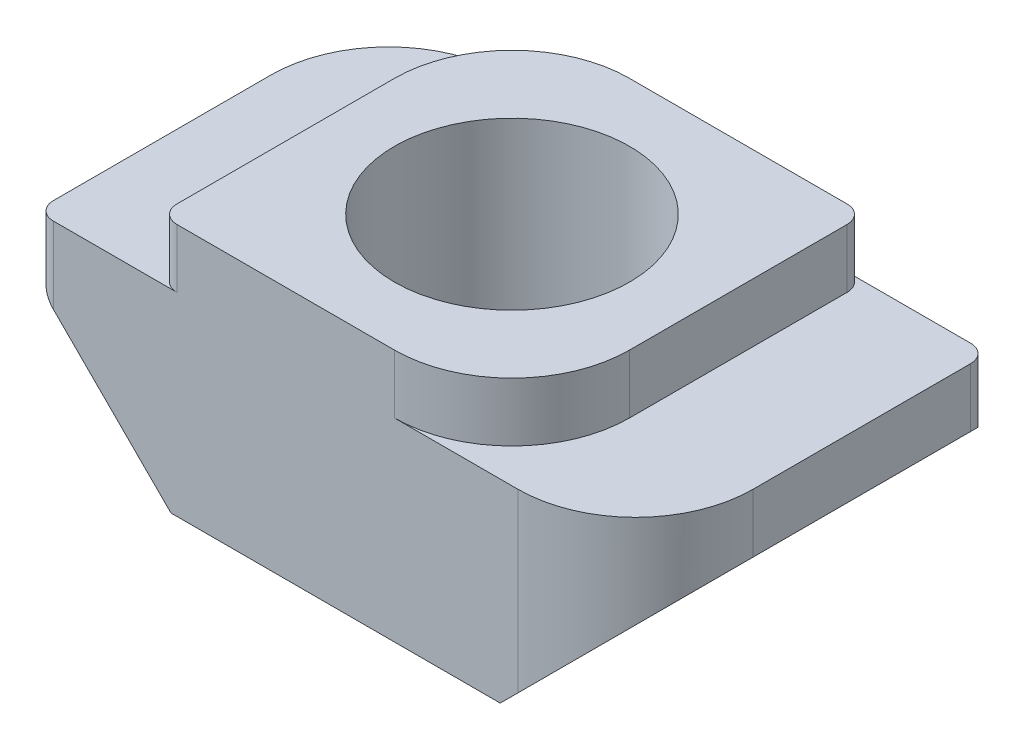
ISO-10303-21;
HEADER;
FILE_DESCRIPTION(('STEP AP214'),'2;1');
FILE_NAME('part.step','',(''),(''),'','','');
FILE_SCHEMA(('AUTOMOTIVE_DESIGN { 1 0 10303 214 1 1 1 1 }'));
ENDSEC;
DATA;
#1=APPLICATION_CONTEXT('core data for automotive mechanical design processes');
#2=APPLICATION_PROTOCOL_DEFINITION('international standard','automotive_design',2000,#1);
#3=PRODUCT_CONTEXT('',#1,'mechanical');
#4=PRODUCT('Part','Part','',(#3));
#5=PRODUCT_RELATED_PRODUCT_CATEGORY('part','',(#4));
#6=PRODUCT_DEFINITION_FORMATION('','',#4);
#7=PRODUCT_DEFINITION_CONTEXT('part definition',#1,'design');
#8=PRODUCT_DEFINITION('design','',#6,#7);
#9=PRODUCT_DEFINITION_SHAPE('','',#8);
#10=(LENGTH_UNIT() NAMED_UNIT(*) SI_UNIT(.MILLI.,.METRE.));
#11=(NAMED_UNIT(*) PLANE_ANGLE_UNIT() SI_UNIT($,.RADIAN.));
#12=(NAMED_UNIT(*) SI_UNIT($,.STERADIAN.) SOLID_ANGLE_UNIT());
#13=UNCERTAINTY_MEASURE_WITH_UNIT(LENGTH_MEASURE(1.E-05),#10,'distance_accuracy_value','');
#14=(GEOMETRIC_REPRESENTATION_CONTEXT(3) GLOBAL_UNCERTAINTY_ASSIGNED_CONTEXT((#13)) GLOBAL_UNIT_ASSIGNED_CONTEXT((#10,
#11,#12)) REPRESENTATION_CONTEXT('',''));
#15=CARTESIAN_POINT('',(0.,0.,0.));
#16=DIRECTION('',(0.,0.,1.));
#17=DIRECTION('',(1.,0.,0.));
#18=AXIS2_PLACEMENT_3D('',#15,#16,#17);
#19=CARTESIAN_POINT('',(3.,4.3,6.));
#20=DIRECTION('',(-1.,0.,0.));
#21=DIRECTION('',(0.,-1.,0.));
#22=AXIS2_PLACEMENT_3D('',#19,#20,#21);
#23=PLANE('',#22);
#24=DIRECTION('',(0.,0.,-1.));
#25=VECTOR('',#24,1.);
#26=CARTESIAN_POINT('',(3.,3.3,6.));
#27=LINE('',#26,#25);
#28=CARTESIAN_POINT('',(3.,3.3,4.));
#29=VERTEX_POINT('',#28);
#30=CARTESIAN_POINT('',(3.,3.3,0.3));
#31=VERTEX_POINT('',#30);
#32=EDGE_CURVE('E197',#29,#31,#27,.T.);
#33=ORIENTED_EDGE('',*,*,#32,.T.);
#34=DIRECTION('',(0.,1.,0.));
#35=VECTOR('',#34,1.);
#36=CARTESIAN_POINT('',(3.,4.3,0.3));
#37=LINE('',#36,#35);
#38=CARTESIAN_POINT('',(3.,4.3,0.3));
#39=VERTEX_POINT('',#38);
#40=EDGE_CURVE('E286',#31,#39,#37,.T.);
#41=ORIENTED_EDGE('',*,*,#40,.T.);
#42=DIRECTION('',(0.,0.,-1.));
#43=VECTOR('',#42,1.);
#44=CARTESIAN_POINT('',(3.,4.3,6.));
#45=LINE('',#44,#43);
#46=CARTESIAN_POINT('',(3.,4.3,4.));
#47=VERTEX_POINT('',#46);
#48=EDGE_CURVE('E226',#47,#39,#45,.T.);
#49=ORIENTED_EDGE('',*,*,#48,.F.);
#50=DIRECTION('',(0.,1.,0.));
#51=VECTOR('',#50,1.);
#52=CARTESIAN_POINT('',(3.,3.3,4.));
#53=LINE('',#52,#51);
#54=EDGE_CURVE('E237',#47,#29,#53,.F.);
#55=ORIENTED_EDGE('',*,*,#54,.T.);
#56=EDGE_LOOP('',(#33,#41,#49,#55));
#57=FACE_BOUND('',#56,.T.);
#58=ADVANCED_FACE('F36',(#57),#23,.F.);
#59=CARTESIAN_POINT('',(-3.,4.3,6.));
#60=DIRECTION('',(0.,-1.,0.));
#61=DIRECTION('',(0.,0.,-1.));
#62=AXIS2_PLACEMENT_3D('',#59,#60,#61);
#63=PLANE('',#62);
#64=CARTESIAN_POINT('',(0.,4.3,3.));
#65=DIRECTION('',(0.,1.,0.));
#66=DIRECTION('',(0.,0.,1.));
#67=AXIS2_PLACEMENT_3D('',#64,#65,#66);
#68=CIRCLE('',#67,2.);
#69=CARTESIAN_POINT('',(0.,4.3,5.));
#70=VERTEX_POINT('',#69);
#71=EDGE_CURVE('E320',#70,#70,#68,.T.);
#72=ORIENTED_EDGE('',*,*,#71,.F.);
#73=EDGE_LOOP('',(#72));
#74=FACE_BOUND('',#73,.T.);
#75=DIRECTION('',(0.,0.,-1.));
#76=VECTOR('',#75,1.);
#77=CARTESIAN_POINT('',(-3.,4.3,6.));
#78=LINE('',#77,#76);
#79=CARTESIAN_POINT('',(-3.,4.3,5.7));
#80=VERTEX_POINT('',#79);
#81=CARTESIAN_POINT('',(-3.,4.3,2.));
#82=VERTEX_POINT('',#81);
#83=EDGE_CURVE('E224',#80,#82,#78,.T.);
#84=ORIENTED_EDGE('',*,*,#83,.F.);
#85=CARTESIAN_POINT('',(-2.7,4.3,5.7));
#86=DIRECTION('',(0.,-1.,0.));
#87=DIRECTION('',(0.,0.,-1.));
#88=AXIS2_PLACEMENT_3D('',#85,#86,#87);
#89=CIRCLE('',#88,0.3);
#90=CARTESIAN_POINT('',(-2.7,4.3,6.));
#91=VERTEX_POINT('',#90);
#92=EDGE_CURVE('E284',#80,#91,#89,.F.);
#93=ORIENTED_EDGE('',*,*,#92,.T.);
#94=DIRECTION('',(-1.,0.,0.));
#95=VECTOR('',#94,1.);
#96=CARTESIAN_POINT('',(-3.,4.3,6.));
#97=LINE('',#96,#95);
#98=CARTESIAN_POINT('',(1.,4.3,6.));
#99=VERTEX_POINT('',#98);
#100=EDGE_CURVE('E210',#99,#91,#97,.T.);
#101=ORIENTED_EDGE('',*,*,#100,.F.);
#102=CARTESIAN_POINT('',(1.,4.3,4.));
#103=DIRECTION('',(0.,-1.,0.));
#104=DIRECTION('',(0.,0.,-1.));
#105=AXIS2_PLACEMENT_3D('',#102,#103,#104);
#106=CIRCLE('',#105,2.);
#107=EDGE_CURVE('E235',#99,#47,#106,.F.);
#108=ORIENTED_EDGE('',*,*,#107,.T.);
#109=ORIENTED_EDGE('',*,*,#48,.T.);
#110=CARTESIAN_POINT('',(2.7,4.3,0.3));
#111=DIRECTION('',(0.,-1.,0.));
#112=DIRECTION('',(0.,0.,-1.));
#113=AXIS2_PLACEMENT_3D('',#110,#111,#112);
#114=CIRCLE('',#113,0.3);
#115=CARTESIAN_POINT('',(2.7,4.3,0.));
#116=VERTEX_POINT('',#115);
#117=EDGE_CURVE('E282',#39,#116,#114,.F.);
#118=ORIENTED_EDGE('',*,*,#117,.T.);
#119=DIRECTION('',(-1.,0.,0.));
#120=VECTOR('',#119,1.);
#121=CARTESIAN_POINT('',(-3.,4.3,0.));
#122=LINE('',#121,#120);
#123=CARTESIAN_POINT('',(-1.,4.3,0.));
#124=VERTEX_POINT('',#123);
#125=EDGE_CURVE('E198',#116,#124,#122,.T.);
#126=ORIENTED_EDGE('',*,*,#125,.T.);
#127=CARTESIAN_POINT('',(-1.,4.3,2.));
#128=DIRECTION('',(0.,-1.,0.));
#129=DIRECTION('',(0.,0.,-1.));
#130=AXIS2_PLACEMENT_3D('',#127,#128,#129);
#131=CIRCLE('',#130,2.);
#132=EDGE_CURVE('E232',#124,#82,#131,.F.);
#133=ORIENTED_EDGE('',*,*,#132,.T.);
#134=EDGE_LOOP('',(#84,#93,#101,#108,#109,#118,#126,#133));
#135=FACE_BOUND('',#134,.T.);
#136=ADVANCED_FACE('F316',(#74,#135),#63,.F.);
#137=CARTESIAN_POINT('',(-3.,4.3,6.));
#138=DIRECTION('',(1.,0.,0.));
#139=DIRECTION('',(0.,1.,0.));
#140=AXIS2_PLACEMENT_3D('',#137,#138,#139);
#141=PLANE('',#140);
#142=DIRECTION('',(0.,0.,-1.));
#143=VECTOR('',#142,1.);
#144=CARTESIAN_POINT('',(-3.,3.3,6.));
#145=LINE('',#144,#143);
#146=CARTESIAN_POINT('',(-3.,3.3,5.7));
#147=VERTEX_POINT('',#146);
#148=CARTESIAN_POINT('',(-3.,3.3,2.));
#149=VERTEX_POINT('',#148);
#150=EDGE_CURVE('E222',#147,#149,#145,.T.);
#151=ORIENTED_EDGE('',*,*,#150,.F.);
#152=DIRECTION('',(0.,-1.,0.));
#153=VECTOR('',#152,1.);
#154=CARTESIAN_POINT('',(-3.,4.3,5.7));
#155=LINE('',#154,#153);
#156=EDGE_CURVE('E280',#147,#80,#155,.F.);
#157=ORIENTED_EDGE('',*,*,#156,.T.);
#158=ORIENTED_EDGE('',*,*,#83,.T.);
#159=DIRECTION('',(0.,-1.,0.));
#160=VECTOR('',#159,1.);
#161=CARTESIAN_POINT('',(-3.,4.3,2.));
#162=LINE('',#161,#160);
#163=EDGE_CURVE('E239',#82,#149,#162,.T.);
#164=ORIENTED_EDGE('',*,*,#163,.T.);
#165=EDGE_LOOP('',(#151,#157,#158,#164));
#166=FACE_BOUND('',#165,.T.);
#167=ADVANCED_FACE('F308',(#166),#141,.F.);
#168=CARTESIAN_POINT('',(-3.,3.3,6.));
#169=DIRECTION('',(0.,-1.,0.));
#170=DIRECTION('',(0.,0.,-1.));
#171=AXIS2_PLACEMENT_3D('',#168,#169,#170);
#172=PLANE('',#171);
#173=DIRECTION('',(0.,0.,-1.));
#174=VECTOR('',#173,1.);
#175=CARTESIAN_POINT('',(-5.1,3.3,6.));
#176=LINE('',#175,#174);
#177=CARTESIAN_POINT('',(-5.1,3.3,5.7));
#178=VERTEX_POINT('',#177);
#179=CARTESIAN_POINT('',(-5.1,3.3,2.));
#180=VERTEX_POINT('',#179);
#181=EDGE_CURVE('E220',#178,#180,#176,.T.);
#182=ORIENTED_EDGE('',*,*,#181,.F.);
#183=CARTESIAN_POINT('',(-4.8,3.3,5.7));
#184=DIRECTION('',(0.,-1.,0.));
#185=DIRECTION('',(0.,0.,-1.));
#186=AXIS2_PLACEMENT_3D('',#183,#184,#185);
#187=CIRCLE('',#186,0.3);
#188=CARTESIAN_POINT('',(-4.8,3.3,6.));
#189=VERTEX_POINT('',#188);
#190=EDGE_CURVE('E278',#178,#189,#187,.F.);
#191=ORIENTED_EDGE('',*,*,#190,.T.);
#192=DIRECTION('',(-1.,0.,0.));
#193=VECTOR('',#192,1.);
#194=CARTESIAN_POINT('',(-3.,3.3,6.));
#195=LINE('',#194,#193);
#196=CARTESIAN_POINT('',(-2.7,3.3,6.));
#197=VERTEX_POINT('',#196);
#198=EDGE_CURVE('E175',#197,#189,#195,.T.);
#199=ORIENTED_EDGE('',*,*,#198,.F.);
#200=CARTESIAN_POINT('',(-2.7,3.3,5.7));
#201=DIRECTION('',(0.,-1.,0.));
#202=DIRECTION('',(0.,0.,-1.));
#203=AXIS2_PLACEMENT_3D('',#200,#201,#202);
#204=CIRCLE('',#203,0.3);
#205=EDGE_CURVE('E45',#197,#147,#204,.T.);
#206=ORIENTED_EDGE('',*,*,#205,.T.);
#207=ORIENTED_EDGE('',*,*,#150,.T.);
#208=CARTESIAN_POINT('',(-1.,3.3,2.));
#209=DIRECTION('',(0.,-1.,0.));
#210=DIRECTION('',(0.,0.,-1.));
#211=AXIS2_PLACEMENT_3D('',#208,#209,#210);
#212=CIRCLE('',#211,2.);
#213=CARTESIAN_POINT('',(-1.,3.3,0.));
#214=VERTEX_POINT('',#213);
#215=EDGE_CURVE('E248',#149,#214,#212,.T.);
#216=ORIENTED_EDGE('',*,*,#215,.T.);
#217=DIRECTION('',(-1.,0.,0.));
#218=VECTOR('',#217,1.);
#219=CARTESIAN_POINT('',(-3.,3.3,0.));
#220=LINE('',#219,#218);
#221=CARTESIAN_POINT('',(-3.1,3.3,0.));
#222=VERTEX_POINT('',#221);
#223=EDGE_CURVE('E200',#214,#222,#220,.T.);
#224=ORIENTED_EDGE('',*,*,#223,.T.);
#225=CARTESIAN_POINT('',(-3.1,3.3,2.));
#226=DIRECTION('',(0.,-1.,0.));
#227=DIRECTION('',(0.,0.,-1.));
#228=AXIS2_PLACEMENT_3D('',#225,#226,#227);
#229=CIRCLE('',#228,2.);
#230=EDGE_CURVE('E267',#222,#180,#229,.F.);
#231=ORIENTED_EDGE('',*,*,#230,.T.);
#232=EDGE_LOOP('',(#182,#191,#199,#206,#207,#216,#224,#231));
#233=FACE_BOUND('',#232,.T.);
#234=ADVANCED_FACE('F302',(#233),#172,.F.);
#235=CARTESIAN_POINT('',(-5.1,3.3,6.));
#236=DIRECTION('',(1.,0.,0.));
#237=DIRECTION('',(0.,0.,-1.));
#238=AXIS2_PLACEMENT_3D('',#235,#236,#237);
#239=PLANE('',#238);
#240=DIRECTION('',(0.,0.,-1.));
#241=VECTOR('',#240,1.);
#242=CARTESIAN_POINT('',(-5.1,2.3,6.));
#243=LINE('',#242,#241);
#244=CARTESIAN_POINT('',(-5.1,2.3,5.7));
#245=VERTEX_POINT('',#244);
#246=CARTESIAN_POINT('',(-5.1,2.3,2.));
#247=VERTEX_POINT('',#246);
#248=EDGE_CURVE('E184',#245,#247,#243,.T.);
#249=ORIENTED_EDGE('',*,*,#248,.F.);
#250=DIRECTION('',(0.,-1.,0.));
#251=VECTOR('',#250,1.);
#252=CARTESIAN_POINT('',(-5.1,3.3,5.7));
#253=LINE('',#252,#251);
#254=EDGE_CURVE('E276',#245,#178,#253,.F.);
#255=ORIENTED_EDGE('',*,*,#254,.T.);
#256=ORIENTED_EDGE('',*,*,#181,.T.);
#257=DIRECTION('',(0.,-1.,0.));
#258=VECTOR('',#257,1.);
#259=CARTESIAN_POINT('',(-5.1,3.3,2.));
#260=LINE('',#259,#258);
#261=EDGE_CURVE('E260',#180,#247,#260,.T.);
#262=ORIENTED_EDGE('',*,*,#261,.T.);
#263=EDGE_LOOP('',(#249,#255,#256,#262));
#264=FACE_BOUND('',#263,.T.);
#265=ADVANCED_FACE('F401',(#264),#239,.F.);
#266=CARTESIAN_POINT('',(-5.1,2.3,6.));
#267=DIRECTION('',(0.707106781186551,0.707106781186544,0.));
#268=DIRECTION('',(-0.707106781186544,0.707106781186551,0.));
#269=AXIS2_PLACEMENT_3D('',#266,#267,#268);
#270=PLANE('',#269);
#271=DIRECTION('',(0.707106781186544,-0.707106781186551,0.));
#272=VECTOR('',#271,1.);
#273=CARTESIAN_POINT('',(-5.1,2.3,6.));
#274=LINE('',#273,#272);
#275=CARTESIAN_POINT('',(-4.8,2.,6.));
#276=VERTEX_POINT('',#275);
#277=CARTESIAN_POINT('',(-2.80000000000002,0.,6.));
#278=VERTEX_POINT('',#277);
#279=EDGE_CURVE('E164',#276,#278,#274,.T.);
#280=ORIENTED_EDGE('',*,*,#279,.F.);
#281=CARTESIAN_POINT('',(-4.8,2.,5.7));
#282=DIRECTION('',(0.707106781186551,0.707106781186544,0.));
#283=DIRECTION('',(-0.707106781186544,0.707106781186551,0.));
#284=AXIS2_PLACEMENT_3D('',#281,#282,#283);
#285=ELLIPSE('',#284,0.424264068711931,0.3);
#286=EDGE_CURVE('E274',#276,#245,#285,.F.);
#287=ORIENTED_EDGE('',*,*,#286,.T.);
#288=ORIENTED_EDGE('',*,*,#248,.T.);
#289=CARTESIAN_POINT('',(-3.1,0.299999999999978,2.));
#290=DIRECTION('',(0.707106781186551,0.707106781186544,0.));
#291=DIRECTION('',(0.707106781186544,-0.707106781186551,0.));
#292=AXIS2_PLACEMENT_3D('',#289,#290,#291);
#293=ELLIPSE('',#292,2.82842712474621,2.);
#294=CARTESIAN_POINT('',(-3.1,0.299999999999978,0.));
#295=VERTEX_POINT('',#294);
#296=EDGE_CURVE('E263',#247,#295,#293,.F.);
#297=ORIENTED_EDGE('',*,*,#296,.T.);
#298=DIRECTION('',(0.707106781186544,-0.707106781186551,0.));
#299=VECTOR('',#298,1.);
#300=CARTESIAN_POINT('',(-5.1,2.3,0.));
#301=LINE('',#300,#299);
#302=CARTESIAN_POINT('',(-2.80000000000002,0.,0.));
#303=VERTEX_POINT('',#302);
#304=EDGE_CURVE('E181',#295,#303,#301,.T.);
#305=ORIENTED_EDGE('',*,*,#304,.T.);
#306=DIRECTION('',(0.,0.,-1.));
#307=VECTOR('',#306,1.);
#308=CARTESIAN_POINT('',(-2.80000000000002,0.,6.));
#309=LINE('',#308,#307);
#310=EDGE_CURVE('E178',#278,#303,#309,.T.);
#311=ORIENTED_EDGE('',*,*,#310,.F.);
#312=EDGE_LOOP('',(#280,#287,#288,#297,#305,#311));
#313=FACE_BOUND('',#312,.T.);
#314=ADVANCED_FACE('F179',(#313),#270,.F.);
#315=CARTESIAN_POINT('',(2.80000000000002,0.,6.));
#316=DIRECTION('',(0.,1.,0.));
#317=DIRECTION('',(0.,0.,1.));
#318=AXIS2_PLACEMENT_3D('',#315,#316,#317);
#319=PLANE('',#318);
#320=CARTESIAN_POINT('',(0.,0.,3.));
#321=DIRECTION('',(0.,1.,0.));
#322=DIRECTION('',(0.,0.,1.));
#323=AXIS2_PLACEMENT_3D('',#320,#321,#322);
#324=CIRCLE('',#323,2.);
#325=CARTESIAN_POINT('',(0.,0.,5.));
#326=VERTEX_POINT('',#325);
#327=EDGE_CURVE('E40',#326,#326,#324,.T.);
#328=ORIENTED_EDGE('',*,*,#327,.T.);
#329=EDGE_LOOP('',(#328));
#330=FACE_BOUND('',#329,.T.);
#331=DIRECTION('',(1.,0.,0.));
#332=VECTOR('',#331,1.);
#333=CARTESIAN_POINT('',(2.80000000000002,0.,0.));
#334=LINE('',#333,#332);
#335=CARTESIAN_POINT('',(2.80000000000002,0.,0.));
#336=VERTEX_POINT('',#335);
#337=EDGE_CURVE('E204',#303,#336,#334,.T.);
#338=ORIENTED_EDGE('',*,*,#337,.T.);
#339=DIRECTION('',(0.,0.,-1.));
#340=VECTOR('',#339,1.);
#341=CARTESIAN_POINT('',(2.80000000000002,0.,6.));
#342=LINE('',#341,#340);
#343=CARTESIAN_POINT('',(2.80000000000002,0.,6.));
#344=VERTEX_POINT('',#343);
#345=EDGE_CURVE('E185',#344,#336,#342,.T.);
#346=ORIENTED_EDGE('',*,*,#345,.F.);
#347=DIRECTION('',(1.,0.,0.));
#348=VECTOR('',#347,1.);
#349=CARTESIAN_POINT('',(2.80000000000002,0.,6.));
#350=LINE('',#349,#348);
#351=EDGE_CURVE('E170',#278,#344,#350,.T.);
#352=ORIENTED_EDGE('',*,*,#351,.F.);
#353=ORIENTED_EDGE('',*,*,#310,.T.);
#354=EDGE_LOOP('',(#338,#346,#352,#353));
#355=FACE_BOUND('',#354,.T.);
#356=ADVANCED_FACE('F187',(#330,#355),#319,.F.);
#357=CARTESIAN_POINT('',(5.1,2.3,6.));
#358=DIRECTION('',(-0.707106781186551,0.707106781186544,0.));
#359=DIRECTION('',(-0.707106781186544,-0.707106781186551,0.));
#360=AXIS2_PLACEMENT_3D('',#357,#358,#359);
#361=PLANE('',#360);
#362=DIRECTION('',(0.707106781186544,0.707106781186551,0.));
#363=VECTOR('',#362,1.);
#364=CARTESIAN_POINT('',(5.1,2.3,0.));
#365=LINE('',#364,#363);
#366=CARTESIAN_POINT('',(4.8,2.,0.));
#367=VERTEX_POINT('',#366);
#368=EDGE_CURVE('E206',#336,#367,#365,.T.);
#369=ORIENTED_EDGE('',*,*,#368,.T.);
#370=CARTESIAN_POINT('',(4.8,2.,0.3));
#371=DIRECTION('',(-0.707106781186551,0.707106781186544,0.));
#372=DIRECTION('',(0.707106781186544,0.707106781186551,0.));
#373=AXIS2_PLACEMENT_3D('',#370,#371,#372);
#374=ELLIPSE('',#373,0.424264068711931,0.3);
#375=CARTESIAN_POINT('',(5.1,2.3,0.3));
#376=VERTEX_POINT('',#375);
#377=EDGE_CURVE('E52',#367,#376,#374,.F.);
#378=ORIENTED_EDGE('',*,*,#377,.T.);
#379=DIRECTION('',(0.,0.,-1.));
#380=VECTOR('',#379,1.);
#381=CARTESIAN_POINT('',(5.1,2.3,6.));
#382=LINE('',#381,#380);
#383=CARTESIAN_POINT('',(5.1,2.3,4.));
#384=VERTEX_POINT('',#383);
#385=EDGE_CURVE('E216',#384,#376,#382,.T.);
#386=ORIENTED_EDGE('',*,*,#385,.F.);
#387=CARTESIAN_POINT('',(3.1,0.299999999999978,4.));
#388=DIRECTION('',(-0.707106781186551,0.707106781186544,0.));
#389=DIRECTION('',(-0.707106781186544,-0.707106781186551,0.));
#390=AXIS2_PLACEMENT_3D('',#387,#388,#389);
#391=ELLIPSE('',#390,2.82842712474621,2.);
#392=CARTESIAN_POINT('',(3.1,0.299999999999978,6.));
#393=VERTEX_POINT('',#392);
#394=EDGE_CURVE('E258',#384,#393,#391,.F.);
#395=ORIENTED_EDGE('',*,*,#394,.T.);
#396=DIRECTION('',(0.707106781186544,0.707106781186551,0.));
#397=VECTOR('',#396,1.);
#398=CARTESIAN_POINT('',(5.1,2.3,6.));
#399=LINE('',#398,#397);
#400=EDGE_CURVE('E190',#344,#393,#399,.T.);
#401=ORIENTED_EDGE('',*,*,#400,.F.);
#402=ORIENTED_EDGE('',*,*,#345,.T.);
#403=EDGE_LOOP('',(#369,#378,#386,#395,#401,#402));
#404=FACE_BOUND('',#403,.T.);
#405=ADVANCED_FACE('F389',(#404),#361,.F.);
#406=CARTESIAN_POINT('',(5.1,3.3,6.));
#407=DIRECTION('',(-1.,0.,0.));
#408=DIRECTION('',(0.,0.,1.));
#409=AXIS2_PLACEMENT_3D('',#406,#407,#408);
#410=PLANE('',#409);
#411=ORIENTED_EDGE('',*,*,#385,.T.);
#412=DIRECTION('',(0.,1.,0.));
#413=VECTOR('',#412,1.);
#414=CARTESIAN_POINT('',(5.1,3.3,0.3));
#415=LINE('',#414,#413);
#416=CARTESIAN_POINT('',(5.1,3.3,0.3));
#417=VERTEX_POINT('',#416);
#418=EDGE_CURVE('E294',#376,#417,#415,.T.);
#419=ORIENTED_EDGE('',*,*,#418,.T.);
#420=DIRECTION('',(0.,0.,-1.));
#421=VECTOR('',#420,1.);
#422=CARTESIAN_POINT('',(5.1,3.3,6.));
#423=LINE('',#422,#421);
#424=CARTESIAN_POINT('',(5.1,3.3,4.));
#425=VERTEX_POINT('',#424);
#426=EDGE_CURVE('E213',#425,#417,#423,.T.);
#427=ORIENTED_EDGE('',*,*,#426,.F.);
#428=DIRECTION('',(0.,1.,0.));
#429=VECTOR('',#428,1.);
#430=CARTESIAN_POINT('',(5.1,2.3,4.));
#431=LINE('',#430,#429);
#432=EDGE_CURVE('E256',#425,#384,#431,.F.);
#433=ORIENTED_EDGE('',*,*,#432,.T.);
#434=EDGE_LOOP('',(#411,#419,#427,#433));
#435=FACE_BOUND('',#434,.T.);
#436=ADVANCED_FACE('F388',(#435),#410,.F.);
#437=CARTESIAN_POINT('',(3.,3.3,6.));
#438=DIRECTION('',(0.,-1.,0.));
#439=DIRECTION('',(0.,0.,-1.));
#440=AXIS2_PLACEMENT_3D('',#437,#438,#439);
#441=PLANE('',#440);
#442=ORIENTED_EDGE('',*,*,#426,.T.);
#443=CARTESIAN_POINT('',(4.8,3.3,0.3));
#444=DIRECTION('',(0.,-1.,0.));
#445=DIRECTION('',(0.,0.,-1.));
#446=AXIS2_PLACEMENT_3D('',#443,#444,#445);
#447=CIRCLE('',#446,0.3);
#448=CARTESIAN_POINT('',(4.8,3.3,0.));
#449=VERTEX_POINT('',#448);
#450=EDGE_CURVE('E60',#417,#449,#447,.F.);
#451=ORIENTED_EDGE('',*,*,#450,.T.);
#452=DIRECTION('',(-1.,0.,0.));
#453=VECTOR('',#452,1.);
#454=CARTESIAN_POINT('',(3.,3.3,0.));
#455=LINE('',#454,#453);
#456=CARTESIAN_POINT('',(2.7,3.3,0.));
#457=VERTEX_POINT('',#456);
#458=EDGE_CURVE('E208',#449,#457,#455,.T.);
#459=ORIENTED_EDGE('',*,*,#458,.T.);
#460=CARTESIAN_POINT('',(2.7,3.3,0.3));
#461=DIRECTION('',(0.,-1.,0.));
#462=DIRECTION('',(0.,0.,-1.));
#463=AXIS2_PLACEMENT_3D('',#460,#461,#462);
#464=CIRCLE('',#463,0.3);
#465=EDGE_CURVE('E11',#457,#31,#464,.T.);
#466=ORIENTED_EDGE('',*,*,#465,.T.);
#467=ORIENTED_EDGE('',*,*,#32,.F.);
#468=CARTESIAN_POINT('',(1.,3.3,4.));
#469=DIRECTION('',(0.,-1.,0.));
#470=DIRECTION('',(0.,0.,-1.));
#471=AXIS2_PLACEMENT_3D('',#468,#469,#470);
#472=CIRCLE('',#471,2.);
#473=CARTESIAN_POINT('',(1.,3.3,6.));
#474=VERTEX_POINT('',#473);
#475=EDGE_CURVE('E245',#29,#474,#472,.T.);
#476=ORIENTED_EDGE('',*,*,#475,.T.);
#477=DIRECTION('',(-1.,0.,0.));
#478=VECTOR('',#477,1.);
#479=CARTESIAN_POINT('',(3.,3.3,6.));
#480=LINE('',#479,#478);
#481=CARTESIAN_POINT('',(3.1,3.3,6.));
#482=VERTEX_POINT('',#481);
#483=EDGE_CURVE('E192',#482,#474,#480,.T.);
#484=ORIENTED_EDGE('',*,*,#483,.F.);
#485=CARTESIAN_POINT('',(3.1,3.3,4.));
#486=DIRECTION('',(0.,-1.,0.));
#487=DIRECTION('',(0.,0.,-1.));
#488=AXIS2_PLACEMENT_3D('',#485,#486,#487);
#489=CIRCLE('',#488,2.);
#490=EDGE_CURVE('E254',#482,#425,#489,.F.);
#491=ORIENTED_EDGE('',*,*,#490,.T.);
#492=EDGE_LOOP('',(#442,#451,#459,#466,#467,#476,#484,#491));
#493=FACE_BOUND('',#492,.T.);
#494=ADVANCED_FACE('F377',(#493),#441,.F.);
#495=CARTESIAN_POINT('',(0.,0.,6.));
#496=DIRECTION('',(0.,0.,1.));
#497=DIRECTION('',(1.,0.,0.));
#498=AXIS2_PLACEMENT_3D('',#495,#496,#497);
#499=PLANE('',#498);
#500=ORIENTED_EDGE('',*,*,#198,.T.);
#501=DIRECTION('',(0.,-1.,0.));
#502=VECTOR('',#501,1.);
#503=CARTESIAN_POINT('',(-4.8,2.3,6.));
#504=LINE('',#503,#502);
#505=EDGE_CURVE('E173',#189,#276,#504,.T.);
#506=ORIENTED_EDGE('',*,*,#505,.T.);
#507=ORIENTED_EDGE('',*,*,#279,.T.);
#508=ORIENTED_EDGE('',*,*,#351,.T.);
#509=ORIENTED_EDGE('',*,*,#400,.T.);
#510=DIRECTION('',(0.,1.,0.));
#511=VECTOR('',#510,1.);
#512=CARTESIAN_POINT('',(3.1,3.3,6.));
#513=LINE('',#512,#511);
#514=EDGE_CURVE('E251',#393,#482,#513,.T.);
#515=ORIENTED_EDGE('',*,*,#514,.T.);
#516=ORIENTED_EDGE('',*,*,#483,.T.);
#517=DIRECTION('',(0.,1.,0.));
#518=VECTOR('',#517,1.);
#519=CARTESIAN_POINT('',(1.,4.3,6.));
#520=LINE('',#519,#518);
#521=EDGE_CURVE('E229',#474,#99,#520,.T.);
#522=ORIENTED_EDGE('',*,*,#521,.T.);
#523=ORIENTED_EDGE('',*,*,#100,.T.);
#524=DIRECTION('',(0.,-1.,0.));
#525=VECTOR('',#524,1.);
#526=CARTESIAN_POINT('',(-2.7,3.3,6.));
#527=LINE('',#526,#525);
#528=EDGE_CURVE('E270',#91,#197,#527,.T.);
#529=ORIENTED_EDGE('',*,*,#528,.T.);
#530=EDGE_LOOP('',(#500,#506,#507,#508,#509,#515,#516,#522,#523,#529));
#531=FACE_BOUND('',#530,.T.);
#532=ADVANCED_FACE('F167',(#531),#499,.T.);
#533=CARTESIAN_POINT('',(0.,0.,0.));
#534=DIRECTION('',(0.,0.,1.));
#535=DIRECTION('',(1.,0.,0.));
#536=AXIS2_PLACEMENT_3D('',#533,#534,#535);
#537=PLANE('',#536);
#538=ORIENTED_EDGE('',*,*,#125,.F.);
#539=DIRECTION('',(0.,1.,0.));
#540=VECTOR('',#539,1.);
#541=CARTESIAN_POINT('',(2.7,0.,0.));
#542=LINE('',#541,#540);
#543=EDGE_CURVE('E291',#116,#457,#542,.F.);
#544=ORIENTED_EDGE('',*,*,#543,.T.);
#545=ORIENTED_EDGE('',*,*,#458,.F.);
#546=DIRECTION('',(0.,1.,0.));
#547=VECTOR('',#546,1.);
#548=CARTESIAN_POINT('',(4.8,0.,0.));
#549=LINE('',#548,#547);
#550=EDGE_CURVE('E289',#449,#367,#549,.F.);
#551=ORIENTED_EDGE('',*,*,#550,.T.);
#552=ORIENTED_EDGE('',*,*,#368,.F.);
#553=ORIENTED_EDGE('',*,*,#337,.F.);
#554=ORIENTED_EDGE('',*,*,#304,.F.);
#555=DIRECTION('',(0.,-1.,0.));
#556=VECTOR('',#555,1.);
#557=CARTESIAN_POINT('',(-3.1,0.,0.));
#558=LINE('',#557,#556);
#559=EDGE_CURVE('E265',#295,#222,#558,.F.);
#560=ORIENTED_EDGE('',*,*,#559,.T.);
#561=ORIENTED_EDGE('',*,*,#223,.F.);
#562=DIRECTION('',(0.,-1.,0.));
#563=VECTOR('',#562,1.);
#564=CARTESIAN_POINT('',(-1.,0.,0.));
#565=LINE('',#564,#563);
#566=EDGE_CURVE('E242',#214,#124,#565,.F.);
#567=ORIENTED_EDGE('',*,*,#566,.T.);
#568=EDGE_LOOP('',(#538,#544,#545,#551,#552,#553,#554,#560,#561,#567));
#569=FACE_BOUND('',#568,.T.);
#570=ADVANCED_FACE('F350',(#569),#537,.F.);
#571=CARTESIAN_POINT('',(1.,0.,4.));
#572=DIRECTION('',(0.,-1.,0.));
#573=DIRECTION('',(1.,0.,0.));
#574=AXIS2_PLACEMENT_3D('',#571,#572,#573);
#575=CYLINDRICAL_SURFACE('',#574,2.);
#576=ORIENTED_EDGE('',*,*,#475,.F.);
#577=ORIENTED_EDGE('',*,*,#54,.F.);
#578=ORIENTED_EDGE('',*,*,#107,.F.);
#579=ORIENTED_EDGE('',*,*,#521,.F.);
#580=EDGE_LOOP('',(#576,#577,#578,#579));
#581=FACE_BOUND('',#580,.T.);
#582=ADVANCED_FACE('F346',(#581),#575,.T.);
#583=CARTESIAN_POINT('',(-1.,4.3,2.));
#584=DIRECTION('',(0.,-1.,0.));
#585=DIRECTION('',(1.,0.,0.));
#586=AXIS2_PLACEMENT_3D('',#583,#584,#585);
#587=CYLINDRICAL_SURFACE('',#586,2.);
#588=ORIENTED_EDGE('',*,*,#132,.F.);
#589=ORIENTED_EDGE('',*,*,#566,.F.);
#590=ORIENTED_EDGE('',*,*,#215,.F.);
#591=ORIENTED_EDGE('',*,*,#163,.F.);
#592=EDGE_LOOP('',(#588,#589,#590,#591));
#593=FACE_BOUND('',#592,.T.);
#594=ADVANCED_FACE('F349',(#593),#587,.T.);
#595=CARTESIAN_POINT('',(3.1,0.,4.));
#596=DIRECTION('',(0.,-1.,0.));
#597=DIRECTION('',(0.,0.,-1.));
#598=AXIS2_PLACEMENT_3D('',#595,#596,#597);
#599=CYLINDRICAL_SURFACE('',#598,2.);
#600=ORIENTED_EDGE('',*,*,#394,.F.);
#601=ORIENTED_EDGE('',*,*,#432,.F.);
#602=ORIENTED_EDGE('',*,*,#490,.F.);
#603=ORIENTED_EDGE('',*,*,#514,.F.);
#604=EDGE_LOOP('',(#600,#601,#602,#603));
#605=FACE_BOUND('',#604,.T.);
#606=ADVANCED_FACE('F354',(#605),#599,.T.);
#607=CARTESIAN_POINT('',(-3.1,3.3,2.));
#608=DIRECTION('',(0.,-1.,0.));
#609=DIRECTION('',(0.,0.,-1.));
#610=AXIS2_PLACEMENT_3D('',#607,#608,#609);
#611=CYLINDRICAL_SURFACE('',#610,2.);
#612=ORIENTED_EDGE('',*,*,#230,.F.);
#613=ORIENTED_EDGE('',*,*,#559,.F.);
#614=ORIENTED_EDGE('',*,*,#296,.F.);
#615=ORIENTED_EDGE('',*,*,#261,.F.);
#616=EDGE_LOOP('',(#612,#613,#614,#615));
#617=FACE_BOUND('',#616,.T.);
#618=ADVANCED_FACE('F358',(#617),#611,.T.);
#619=CARTESIAN_POINT('',(-4.8,0.,5.7));
#620=DIRECTION('',(0.,1.,0.));
#621=DIRECTION('',(0.,0.,1.));
#622=AXIS2_PLACEMENT_3D('',#619,#620,#621);
#623=CYLINDRICAL_SURFACE('',#622,0.3);
#624=ORIENTED_EDGE('',*,*,#190,.F.);
#625=ORIENTED_EDGE('',*,*,#254,.F.);
#626=ORIENTED_EDGE('',*,*,#286,.F.);
#627=ORIENTED_EDGE('',*,*,#505,.F.);
#628=EDGE_LOOP('',(#624,#625,#626,#627));
#629=FACE_BOUND('',#628,.T.);
#630=ADVANCED_FACE('F362',(#629),#623,.T.);
#631=CARTESIAN_POINT('',(-2.7,0.,5.7));
#632=DIRECTION('',(0.,1.,0.));
#633=DIRECTION('',(-1.,0.,0.));
#634=AXIS2_PLACEMENT_3D('',#631,#632,#633);
#635=CYLINDRICAL_SURFACE('',#634,0.3);
#636=ORIENTED_EDGE('',*,*,#92,.F.);
#637=ORIENTED_EDGE('',*,*,#156,.F.);
#638=ORIENTED_EDGE('',*,*,#205,.F.);
#639=ORIENTED_EDGE('',*,*,#528,.F.);
#640=EDGE_LOOP('',(#636,#637,#638,#639));
#641=FACE_BOUND('',#640,.T.);
#642=ADVANCED_FACE('F312',(#641),#635,.T.);
#643=CARTESIAN_POINT('',(2.7,4.3,0.3));
#644=DIRECTION('',(0.,1.,0.));
#645=DIRECTION('',(-1.,0.,0.));
#646=AXIS2_PLACEMENT_3D('',#643,#644,#645);
#647=CYLINDRICAL_SURFACE('',#646,0.3);
#648=ORIENTED_EDGE('',*,*,#465,.F.);
#649=ORIENTED_EDGE('',*,*,#543,.F.);
#650=ORIENTED_EDGE('',*,*,#117,.F.);
#651=ORIENTED_EDGE('',*,*,#40,.F.);
#652=EDGE_LOOP('',(#648,#649,#650,#651));
#653=FACE_BOUND('',#652,.T.);
#654=ADVANCED_FACE('F334',(#653),#647,.T.);
#655=CARTESIAN_POINT('',(4.8,3.3,0.3));
#656=DIRECTION('',(0.,1.,0.));
#657=DIRECTION('',(0.,0.,1.));
#658=AXIS2_PLACEMENT_3D('',#655,#656,#657);
#659=CYLINDRICAL_SURFACE('',#658,0.3);
#660=ORIENTED_EDGE('',*,*,#377,.F.);
#661=ORIENTED_EDGE('',*,*,#550,.F.);
#662=ORIENTED_EDGE('',*,*,#450,.F.);
#663=ORIENTED_EDGE('',*,*,#418,.F.);
#664=EDGE_LOOP('',(#660,#661,#662,#663));
#665=FACE_BOUND('',#664,.T.);
#666=ADVANCED_FACE('F38',(#665),#659,.T.);
#667=CARTESIAN_POINT('',(0.,-1.7,3.));
#668=DIRECTION('',(0.,1.,0.));
#669=DIRECTION('',(0.,0.,1.));
#670=AXIS2_PLACEMENT_3D('',#667,#668,#669);
#671=CYLINDRICAL_SURFACE('',#670,2.);
#672=ORIENTED_EDGE('',*,*,#71,.T.);
#673=EDGE_LOOP('',(#672));
#674=FACE_BOUND('',#673,.T.);
#675=ORIENTED_EDGE('',*,*,#327,.F.);
#676=EDGE_LOOP('',(#675));
#677=FACE_BOUND('',#676,.T.);
#678=ADVANCED_FACE('F328',(#674,#677),#671,.F.);
#679=CLOSED_SHELL('',(#58,#136,#167,#234,#265,#314,#356,#405,#436,#494,#532,#570,#582,#594,#606,
#618,#630,#642,#654,#666,#678));
#680=MANIFOLD_SOLID_BREP('B2',#679);
#681=ADVANCED_BREP_SHAPE_REPRESENTATION('',(#18,#680),#14);
#682=SHAPE_DEFINITION_REPRESENTATION(#9,#681);
ENDSEC;
END-ISO-10303-21;
